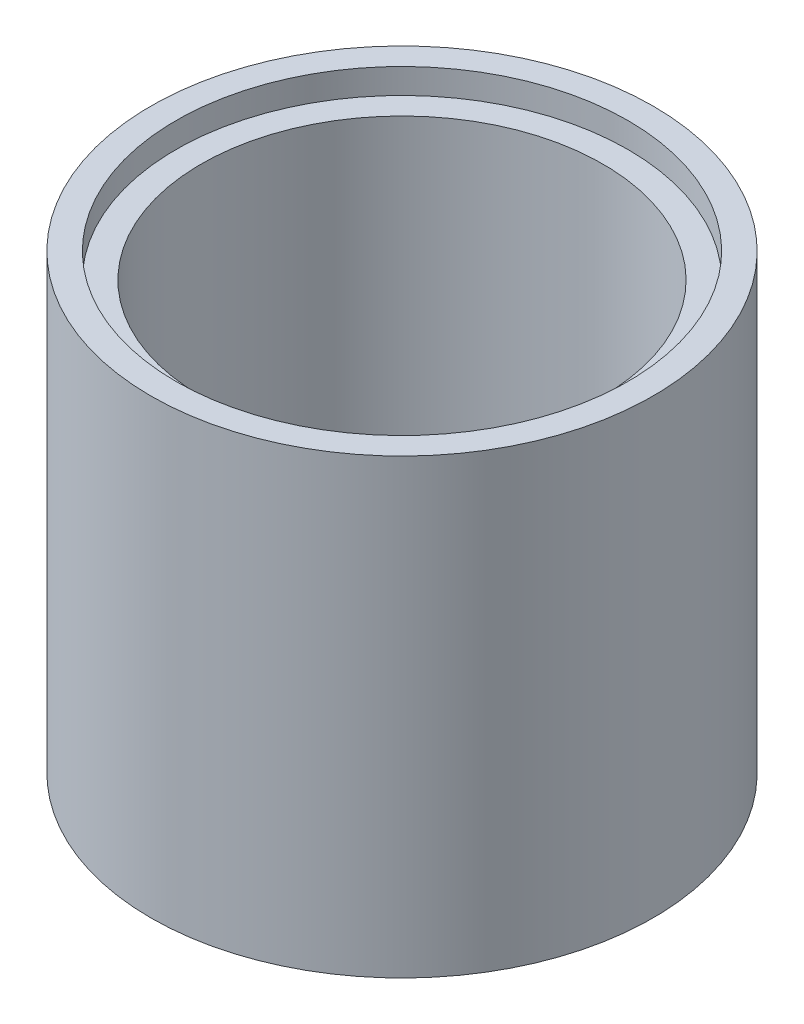
ISO-10303-21;
HEADER;
FILE_DESCRIPTION(('STEP AP214'),'2;1');
FILE_NAME('part.step','',(''),(''),'','','');
FILE_SCHEMA(('AUTOMOTIVE_DESIGN { 1 0 10303 214 1 1 1 1 }'));
ENDSEC;
DATA;
#1=APPLICATION_CONTEXT('core data for automotive mechanical design processes');
#2=APPLICATION_PROTOCOL_DEFINITION('international standard','automotive_design',2000,#1);
#3=PRODUCT_CONTEXT('',#1,'mechanical');
#4=PRODUCT('Part','Part','',(#3));
#5=PRODUCT_RELATED_PRODUCT_CATEGORY('part','',(#4));
#6=PRODUCT_DEFINITION_FORMATION('','',#4);
#7=PRODUCT_DEFINITION_CONTEXT('part definition',#1,'design');
#8=PRODUCT_DEFINITION('design','',#6,#7);
#9=PRODUCT_DEFINITION_SHAPE('','',#8);
#10=(LENGTH_UNIT() NAMED_UNIT(*) SI_UNIT(.MILLI.,.METRE.));
#11=(NAMED_UNIT(*) PLANE_ANGLE_UNIT() SI_UNIT($,.RADIAN.));
#12=(NAMED_UNIT(*) SI_UNIT($,.STERADIAN.) SOLID_ANGLE_UNIT());
#13=UNCERTAINTY_MEASURE_WITH_UNIT(LENGTH_MEASURE(1.E-05),#10,'distance_accuracy_value','');
#14=(GEOMETRIC_REPRESENTATION_CONTEXT(3) GLOBAL_UNCERTAINTY_ASSIGNED_CONTEXT((#13)) GLOBAL_UNIT_ASSIGNED_CONTEXT((#10,
#11,#12)) REPRESENTATION_CONTEXT('',''));
#15=CARTESIAN_POINT('',(0.,0.,0.));
#16=DIRECTION('',(0.,0.,1.));
#17=DIRECTION('',(1.,0.,0.));
#18=AXIS2_PLACEMENT_3D('',#15,#16,#17);
#19=CARTESIAN_POINT('',(0.,45.,0.));
#20=DIRECTION('',(0.,-1.,0.));
#21=DIRECTION('',(0.,0.,-1.));
#22=AXIS2_PLACEMENT_3D('',#19,#20,#21);
#23=CYLINDRICAL_SURFACE('',#22,25.);
#24=CARTESIAN_POINT('',(0.,45.,0.));
#25=DIRECTION('',(0.,1.,0.));
#26=DIRECTION('',(0.,0.,1.));
#27=AXIS2_PLACEMENT_3D('',#24,#25,#26);
#28=CIRCLE('',#27,25.);
#29=CARTESIAN_POINT('',(0.,45.,25.));
#30=VERTEX_POINT('',#29);
#31=EDGE_CURVE('E10',#30,#30,#28,.T.);
#32=ORIENTED_EDGE('',*,*,#31,.F.);
#33=EDGE_LOOP('',(#32));
#34=FACE_BOUND('',#33,.T.);
#35=CARTESIAN_POINT('',(0.,0.,0.));
#36=DIRECTION('',(0.,1.,0.));
#37=DIRECTION('',(0.,0.,1.));
#38=AXIS2_PLACEMENT_3D('',#35,#36,#37);
#39=CIRCLE('',#38,25.);
#40=CARTESIAN_POINT('',(0.,0.,25.));
#41=VERTEX_POINT('',#40);
#42=EDGE_CURVE('E44',#41,#41,#39,.T.);
#43=ORIENTED_EDGE('',*,*,#42,.T.);
#44=EDGE_LOOP('',(#43));
#45=FACE_BOUND('',#44,.T.);
#46=ADVANCED_FACE('F36',(#34,#45),#23,.T.);
#47=CARTESIAN_POINT('',(0.,45.,0.));
#48=DIRECTION('',(0.,1.,0.));
#49=DIRECTION('',(0.,0.,1.));
#50=AXIS2_PLACEMENT_3D('',#47,#48,#49);
#51=PLANE('',#50);
#52=CARTESIAN_POINT('',(0.,45.,0.));
#53=DIRECTION('',(0.,1.,0.));
#54=DIRECTION('',(0.,0.,1.));
#55=AXIS2_PLACEMENT_3D('',#52,#53,#54);
#56=CIRCLE('',#55,22.5);
#57=CARTESIAN_POINT('',(0.,45.,22.5));
#58=VERTEX_POINT('',#57);
#59=EDGE_CURVE('E55',#58,#58,#56,.T.);
#60=ORIENTED_EDGE('',*,*,#59,.F.);
#61=EDGE_LOOP('',(#60));
#62=FACE_BOUND('',#61,.T.);
#63=ORIENTED_EDGE('',*,*,#31,.T.);
#64=EDGE_LOOP('',(#63));
#65=FACE_BOUND('',#64,.T.);
#66=ADVANCED_FACE('F85',(#62,#65),#51,.T.);
#67=CARTESIAN_POINT('',(0.,0.,0.));
#68=DIRECTION('',(0.,1.,0.));
#69=DIRECTION('',(0.,0.,1.));
#70=AXIS2_PLACEMENT_3D('',#67,#68,#69);
#71=PLANE('',#70);
#72=ORIENTED_EDGE('',*,*,#42,.F.);
#73=EDGE_LOOP('',(#72));
#74=FACE_BOUND('',#73,.T.);
#75=ADVANCED_FACE('F91',(#74),#71,.F.);
#76=CARTESIAN_POINT('',(0.,42.5,0.));
#77=DIRECTION('',(0.,1.,0.));
#78=DIRECTION('',(0.,0.,1.));
#79=AXIS2_PLACEMENT_3D('',#76,#77,#78);
#80=PLANE('',#79);
#81=CARTESIAN_POINT('',(0.,42.5,0.));
#82=DIRECTION('',(0.,1.,0.));
#83=DIRECTION('',(0.,0.,1.));
#84=AXIS2_PLACEMENT_3D('',#81,#82,#83);
#85=CIRCLE('',#84,22.5);
#86=CARTESIAN_POINT('',(0.,42.5,22.5));
#87=VERTEX_POINT('',#86);
#88=EDGE_CURVE('E59',#87,#87,#85,.T.);
#89=ORIENTED_EDGE('',*,*,#88,.T.);
#90=EDGE_LOOP('',(#89));
#91=FACE_BOUND('',#90,.T.);
#92=CARTESIAN_POINT('',(0.,42.5,0.));
#93=DIRECTION('',(0.,1.,0.));
#94=DIRECTION('',(0.,0.,1.));
#95=AXIS2_PLACEMENT_3D('',#92,#93,#94);
#96=CIRCLE('',#95,20.);
#97=CARTESIAN_POINT('',(0.,42.5,20.));
#98=VERTEX_POINT('',#97);
#99=EDGE_CURVE('E39',#98,#98,#96,.F.);
#100=ORIENTED_EDGE('',*,*,#99,.T.);
#101=EDGE_LOOP('',(#100));
#102=FACE_BOUND('',#101,.T.);
#103=ADVANCED_FACE('F68',(#91,#102),#80,.T.);
#104=CARTESIAN_POINT('',(0.,42.5,0.));
#105=DIRECTION('',(0.,1.,0.));
#106=DIRECTION('',(0.,0.,1.));
#107=AXIS2_PLACEMENT_3D('',#104,#105,#106);
#108=CYLINDRICAL_SURFACE('',#107,22.5);
#109=ORIENTED_EDGE('',*,*,#88,.F.);
#110=EDGE_LOOP('',(#109));
#111=FACE_BOUND('',#110,.T.);
#112=ORIENTED_EDGE('',*,*,#59,.T.);
#113=EDGE_LOOP('',(#112));
#114=FACE_BOUND('',#113,.T.);
#115=ADVANCED_FACE('F79',(#111,#114),#108,.F.);
#116=CARTESIAN_POINT('',(0.,5.,0.));
#117=DIRECTION('',(0.,1.,0.));
#118=DIRECTION('',(0.,0.,1.));
#119=AXIS2_PLACEMENT_3D('',#116,#117,#118);
#120=PLANE('',#119);
#121=CARTESIAN_POINT('',(0.,5.,0.));
#122=DIRECTION('',(0.,1.,0.));
#123=DIRECTION('',(0.,0.,1.));
#124=AXIS2_PLACEMENT_3D('',#121,#122,#123);
#125=CIRCLE('',#124,20.);
#126=CARTESIAN_POINT('',(0.,5.,20.));
#127=VERTEX_POINT('',#126);
#128=EDGE_CURVE('E50',#127,#127,#125,.T.);
#129=ORIENTED_EDGE('',*,*,#128,.T.);
#130=EDGE_LOOP('',(#129));
#131=FACE_BOUND('',#130,.T.);
#132=ADVANCED_FACE('F72',(#131),#120,.T.);
#133=CARTESIAN_POINT('',(0.,5.,0.));
#134=DIRECTION('',(0.,1.,0.));
#135=DIRECTION('',(0.,0.,1.));
#136=AXIS2_PLACEMENT_3D('',#133,#134,#135);
#137=CYLINDRICAL_SURFACE('',#136,20.);
#138=ORIENTED_EDGE('',*,*,#128,.F.);
#139=EDGE_LOOP('',(#138));
#140=FACE_BOUND('',#139,.T.);
#141=ORIENTED_EDGE('',*,*,#99,.F.);
#142=EDGE_LOOP('',(#141));
#143=FACE_BOUND('',#142,.T.);
#144=ADVANCED_FACE('F70',(#140,#143),#137,.F.);
#145=CLOSED_SHELL('',(#46,#66,#75,#103,#115,#132,#144));
#146=MANIFOLD_SOLID_BREP('B2',#145);
#147=ADVANCED_BREP_SHAPE_REPRESENTATION('',(#18,#146),#14);
#148=SHAPE_DEFINITION_REPRESENTATION(#9,#147);
ENDSEC;
END-ISO-10303-21;
